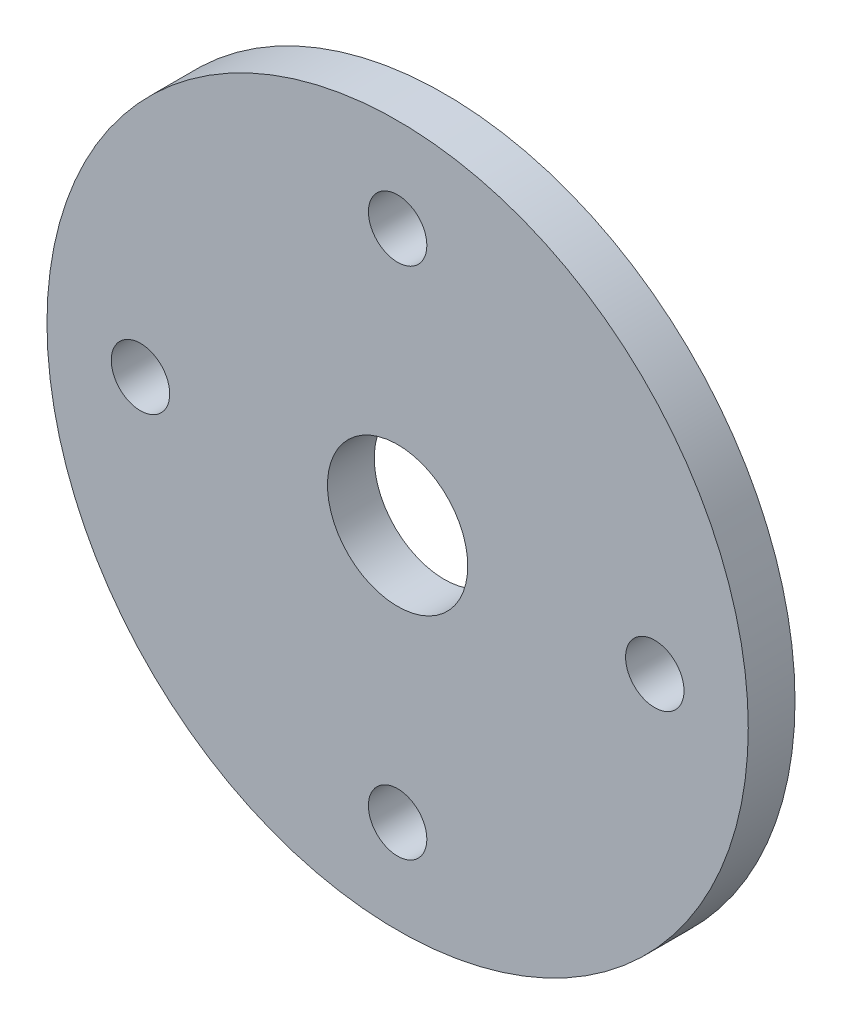
ISO-10303-21;
HEADER;
FILE_DESCRIPTION(('STEP AP214'),'2;1');
FILE_NAME('part.step','',(''),(''),'','','');
FILE_SCHEMA(('AUTOMOTIVE_DESIGN { 1 0 10303 214 1 1 1 1 }'));
ENDSEC;
DATA;
#1=APPLICATION_CONTEXT('core data for automotive mechanical design processes');
#2=APPLICATION_PROTOCOL_DEFINITION('international standard','automotive_design',2000,#1);
#3=PRODUCT_CONTEXT('',#1,'mechanical');
#4=PRODUCT('Part','Part','',(#3));
#5=PRODUCT_RELATED_PRODUCT_CATEGORY('part','',(#4));
#6=PRODUCT_DEFINITION_FORMATION('','',#4);
#7=PRODUCT_DEFINITION_CONTEXT('part definition',#1,'design');
#8=PRODUCT_DEFINITION('design','',#6,#7);
#9=PRODUCT_DEFINITION_SHAPE('','',#8);
#10=(LENGTH_UNIT() NAMED_UNIT(*) SI_UNIT(.MILLI.,.METRE.));
#11=(NAMED_UNIT(*) PLANE_ANGLE_UNIT() SI_UNIT($,.RADIAN.));
#12=(NAMED_UNIT(*) SI_UNIT($,.STERADIAN.) SOLID_ANGLE_UNIT());
#13=UNCERTAINTY_MEASURE_WITH_UNIT(LENGTH_MEASURE(1.E-05),#10,'distance_accuracy_value','');
#14=(GEOMETRIC_REPRESENTATION_CONTEXT(3) GLOBAL_UNCERTAINTY_ASSIGNED_CONTEXT((#13)) GLOBAL_UNIT_ASSIGNED_CONTEXT((#10,
#11,#12)) REPRESENTATION_CONTEXT('',''));
#15=CARTESIAN_POINT('',(0.,0.,0.));
#16=DIRECTION('',(0.,0.,1.));
#17=DIRECTION('',(1.,0.,0.));
#18=AXIS2_PLACEMENT_3D('',#15,#16,#17);
#19=CARTESIAN_POINT('',(0.,0.,5.));
#20=DIRECTION('',(0.,0.,1.));
#21=DIRECTION('',(1.,0.,0.));
#22=AXIS2_PLACEMENT_3D('',#19,#20,#21);
#23=PLANE('',#22);
#24=CARTESIAN_POINT('',(0.,-55.,5.));
#25=DIRECTION('',(0.,0.,1.));
#26=DIRECTION('',(1.,0.,0.));
#27=AXIS2_PLACEMENT_3D('',#24,#25,#26);
#28=CIRCLE('',#27,6.25);
#29=CARTESIAN_POINT('',(6.24999999999998,-55.,5.));
#30=VERTEX_POINT('',#29);
#31=EDGE_CURVE('E59',#30,#30,#28,.T.);
#32=ORIENTED_EDGE('',*,*,#31,.F.);
#33=EDGE_LOOP('',(#32));
#34=FACE_BOUND('',#33,.T.);
#35=CARTESIAN_POINT('',(0.,55.,5.));
#36=DIRECTION('',(0.,0.,1.));
#37=DIRECTION('',(1.,0.,0.));
#38=AXIS2_PLACEMENT_3D('',#35,#36,#37);
#39=CIRCLE('',#38,6.25);
#40=CARTESIAN_POINT('',(6.24999999999998,55.,5.));
#41=VERTEX_POINT('',#40);
#42=EDGE_CURVE('E47',#41,#41,#39,.T.);
#43=ORIENTED_EDGE('',*,*,#42,.F.);
#44=EDGE_LOOP('',(#43));
#45=FACE_BOUND('',#44,.T.);
#46=CARTESIAN_POINT('',(0.,0.,5.));
#47=DIRECTION('',(0.,0.,1.));
#48=DIRECTION('',(1.,0.,0.));
#49=AXIS2_PLACEMENT_3D('',#46,#47,#48);
#50=CIRCLE('',#49,75.);
#51=CARTESIAN_POINT('',(75.,0.,5.));
#52=VERTEX_POINT('',#51);
#53=EDGE_CURVE('E10',#52,#52,#50,.T.);
#54=ORIENTED_EDGE('',*,*,#53,.T.);
#55=EDGE_LOOP('',(#54));
#56=FACE_BOUND('',#55,.T.);
#57=CARTESIAN_POINT('',(0.,0.,5.));
#58=DIRECTION('',(0.,0.,1.));
#59=DIRECTION('',(1.,0.,0.));
#60=AXIS2_PLACEMENT_3D('',#57,#58,#59);
#61=CIRCLE('',#60,15.);
#62=CARTESIAN_POINT('',(15.,0.,5.));
#63=VERTEX_POINT('',#62);
#64=EDGE_CURVE('E42',#63,#63,#61,.T.);
#65=ORIENTED_EDGE('',*,*,#64,.F.);
#66=EDGE_LOOP('',(#65));
#67=FACE_BOUND('',#66,.T.);
#68=CARTESIAN_POINT('',(-55.,0.,5.));
#69=DIRECTION('',(0.,0.,1.));
#70=DIRECTION('',(1.,0.,0.));
#71=AXIS2_PLACEMENT_3D('',#68,#69,#70);
#72=CIRCLE('',#71,6.25);
#73=CARTESIAN_POINT('',(-48.75,0.,5.));
#74=VERTEX_POINT('',#73);
#75=EDGE_CURVE('E53',#74,#74,#72,.T.);
#76=ORIENTED_EDGE('',*,*,#75,.F.);
#77=EDGE_LOOP('',(#76));
#78=FACE_BOUND('',#77,.T.);
#79=CARTESIAN_POINT('',(55.,0.,5.));
#80=DIRECTION('',(0.,0.,1.));
#81=DIRECTION('',(1.,0.,0.));
#82=AXIS2_PLACEMENT_3D('',#79,#80,#81);
#83=CIRCLE('',#82,6.25);
#84=CARTESIAN_POINT('',(61.25,0.,5.));
#85=VERTEX_POINT('',#84);
#86=EDGE_CURVE('E65',#85,#85,#83,.T.);
#87=ORIENTED_EDGE('',*,*,#86,.F.);
#88=EDGE_LOOP('',(#87));
#89=FACE_BOUND('',#88,.T.);
#90=ADVANCED_FACE('F31',(#34,#45,#56,#67,#78,#89),#23,.T.);
#91=CARTESIAN_POINT('',(0.,0.,-5.));
#92=DIRECTION('',(0.,0.,1.));
#93=DIRECTION('',(1.,0.,0.));
#94=AXIS2_PLACEMENT_3D('',#91,#92,#93);
#95=PLANE('',#94);
#96=CARTESIAN_POINT('',(0.,0.,-5.));
#97=DIRECTION('',(0.,0.,1.));
#98=DIRECTION('',(1.,0.,0.));
#99=AXIS2_PLACEMENT_3D('',#96,#97,#98);
#100=CIRCLE('',#99,75.);
#101=CARTESIAN_POINT('',(75.,0.,-5.));
#102=VERTEX_POINT('',#101);
#103=EDGE_CURVE('E35',#102,#102,#100,.T.);
#104=ORIENTED_EDGE('',*,*,#103,.F.);
#105=EDGE_LOOP('',(#104));
#106=FACE_BOUND('',#105,.T.);
#107=CARTESIAN_POINT('',(0.,0.,-5.));
#108=DIRECTION('',(0.,0.,1.));
#109=DIRECTION('',(1.,0.,0.));
#110=AXIS2_PLACEMENT_3D('',#107,#108,#109);
#111=CIRCLE('',#110,15.);
#112=CARTESIAN_POINT('',(15.,0.,-5.));
#113=VERTEX_POINT('',#112);
#114=EDGE_CURVE('E44',#113,#113,#111,.T.);
#115=ORIENTED_EDGE('',*,*,#114,.T.);
#116=EDGE_LOOP('',(#115));
#117=FACE_BOUND('',#116,.T.);
#118=CARTESIAN_POINT('',(0.,55.,-5.));
#119=DIRECTION('',(0.,0.,1.));
#120=DIRECTION('',(1.,0.,0.));
#121=AXIS2_PLACEMENT_3D('',#118,#119,#120);
#122=CIRCLE('',#121,6.25);
#123=CARTESIAN_POINT('',(6.24999999999998,55.,-5.));
#124=VERTEX_POINT('',#123);
#125=EDGE_CURVE('E50',#124,#124,#122,.T.);
#126=ORIENTED_EDGE('',*,*,#125,.T.);
#127=EDGE_LOOP('',(#126));
#128=FACE_BOUND('',#127,.T.);
#129=CARTESIAN_POINT('',(-55.,0.,-5.));
#130=DIRECTION('',(0.,0.,1.));
#131=DIRECTION('',(1.,0.,0.));
#132=AXIS2_PLACEMENT_3D('',#129,#130,#131);
#133=CIRCLE('',#132,6.25);
#134=CARTESIAN_POINT('',(-48.75,0.,-5.));
#135=VERTEX_POINT('',#134);
#136=EDGE_CURVE('E56',#135,#135,#133,.T.);
#137=ORIENTED_EDGE('',*,*,#136,.T.);
#138=EDGE_LOOP('',(#137));
#139=FACE_BOUND('',#138,.T.);
#140=CARTESIAN_POINT('',(0.,-55.,-5.));
#141=DIRECTION('',(0.,0.,1.));
#142=DIRECTION('',(1.,0.,0.));
#143=AXIS2_PLACEMENT_3D('',#140,#141,#142);
#144=CIRCLE('',#143,6.25);
#145=CARTESIAN_POINT('',(6.24999999999998,-55.,-5.));
#146=VERTEX_POINT('',#145);
#147=EDGE_CURVE('E62',#146,#146,#144,.T.);
#148=ORIENTED_EDGE('',*,*,#147,.T.);
#149=EDGE_LOOP('',(#148));
#150=FACE_BOUND('',#149,.T.);
#151=CARTESIAN_POINT('',(55.,0.,-5.));
#152=DIRECTION('',(0.,0.,1.));
#153=DIRECTION('',(1.,0.,0.));
#154=AXIS2_PLACEMENT_3D('',#151,#152,#153);
#155=CIRCLE('',#154,6.25);
#156=CARTESIAN_POINT('',(61.25,0.,-5.));
#157=VERTEX_POINT('',#156);
#158=EDGE_CURVE('E68',#157,#157,#155,.T.);
#159=ORIENTED_EDGE('',*,*,#158,.T.);
#160=EDGE_LOOP('',(#159));
#161=FACE_BOUND('',#160,.T.);
#162=ADVANCED_FACE('F78',(#106,#117,#128,#139,#150,#161),#95,.F.);
#163=CARTESIAN_POINT('',(0.,0.,5.));
#164=DIRECTION('',(0.,0.,-1.));
#165=DIRECTION('',(-1.,0.,0.));
#166=AXIS2_PLACEMENT_3D('',#163,#164,#165);
#167=CYLINDRICAL_SURFACE('',#166,75.);
#168=ORIENTED_EDGE('',*,*,#53,.F.);
#169=EDGE_LOOP('',(#168));
#170=FACE_BOUND('',#169,.T.);
#171=ORIENTED_EDGE('',*,*,#103,.T.);
#172=EDGE_LOOP('',(#171));
#173=FACE_BOUND('',#172,.T.);
#174=ADVANCED_FACE('F33',(#170,#173),#167,.T.);
#175=CARTESIAN_POINT('',(0.,0.,5.));
#176=DIRECTION('',(0.,0.,-1.));
#177=DIRECTION('',(-1.,0.,0.));
#178=AXIS2_PLACEMENT_3D('',#175,#176,#177);
#179=CYLINDRICAL_SURFACE('',#178,15.);
#180=ORIENTED_EDGE('',*,*,#64,.T.);
#181=EDGE_LOOP('',(#180));
#182=FACE_BOUND('',#181,.T.);
#183=ORIENTED_EDGE('',*,*,#114,.F.);
#184=EDGE_LOOP('',(#183));
#185=FACE_BOUND('',#184,.T.);
#186=ADVANCED_FACE('F88',(#182,#185),#179,.F.);
#187=CARTESIAN_POINT('',(0.,55.,5.));
#188=DIRECTION('',(0.,0.,-1.));
#189=DIRECTION('',(-1.,0.,0.));
#190=AXIS2_PLACEMENT_3D('',#187,#188,#189);
#191=CYLINDRICAL_SURFACE('',#190,6.25);
#192=ORIENTED_EDGE('',*,*,#42,.T.);
#193=EDGE_LOOP('',(#192));
#194=FACE_BOUND('',#193,.T.);
#195=ORIENTED_EDGE('',*,*,#125,.F.);
#196=EDGE_LOOP('',(#195));
#197=FACE_BOUND('',#196,.T.);
#198=ADVANCED_FACE('F91',(#194,#197),#191,.F.);
#199=CARTESIAN_POINT('',(-55.,0.,5.));
#200=DIRECTION('',(0.,0.,-1.));
#201=DIRECTION('',(-1.,0.,0.));
#202=AXIS2_PLACEMENT_3D('',#199,#200,#201);
#203=CYLINDRICAL_SURFACE('',#202,6.25);
#204=ORIENTED_EDGE('',*,*,#75,.T.);
#205=EDGE_LOOP('',(#204));
#206=FACE_BOUND('',#205,.T.);
#207=ORIENTED_EDGE('',*,*,#136,.F.);
#208=EDGE_LOOP('',(#207));
#209=FACE_BOUND('',#208,.T.);
#210=ADVANCED_FACE('F95',(#206,#209),#203,.F.);
#211=CARTESIAN_POINT('',(0.,-55.,5.));
#212=DIRECTION('',(0.,0.,-1.));
#213=DIRECTION('',(-1.,0.,0.));
#214=AXIS2_PLACEMENT_3D('',#211,#212,#213);
#215=CYLINDRICAL_SURFACE('',#214,6.25);
#216=ORIENTED_EDGE('',*,*,#31,.T.);
#217=EDGE_LOOP('',(#216));
#218=FACE_BOUND('',#217,.T.);
#219=ORIENTED_EDGE('',*,*,#147,.F.);
#220=EDGE_LOOP('',(#219));
#221=FACE_BOUND('',#220,.T.);
#222=ADVANCED_FACE('F99',(#218,#221),#215,.F.);
#223=CARTESIAN_POINT('',(55.,0.,5.));
#224=DIRECTION('',(0.,0.,-1.));
#225=DIRECTION('',(-1.,0.,0.));
#226=AXIS2_PLACEMENT_3D('',#223,#224,#225);
#227=CYLINDRICAL_SURFACE('',#226,6.25);
#228=ORIENTED_EDGE('',*,*,#86,.T.);
#229=EDGE_LOOP('',(#228));
#230=FACE_BOUND('',#229,.T.);
#231=ORIENTED_EDGE('',*,*,#158,.F.);
#232=EDGE_LOOP('',(#231));
#233=FACE_BOUND('',#232,.T.);
#234=ADVANCED_FACE('F74',(#230,#233),#227,.F.);
#235=CLOSED_SHELL('',(#90,#162,#174,#186,#198,#210,#222,#234));
#236=MANIFOLD_SOLID_BREP('B2',#235);
#237=ADVANCED_BREP_SHAPE_REPRESENTATION('',(#18,#236),#14);
#238=SHAPE_DEFINITION_REPRESENTATION(#9,#237);
ENDSEC;
END-ISO-10303-21;
